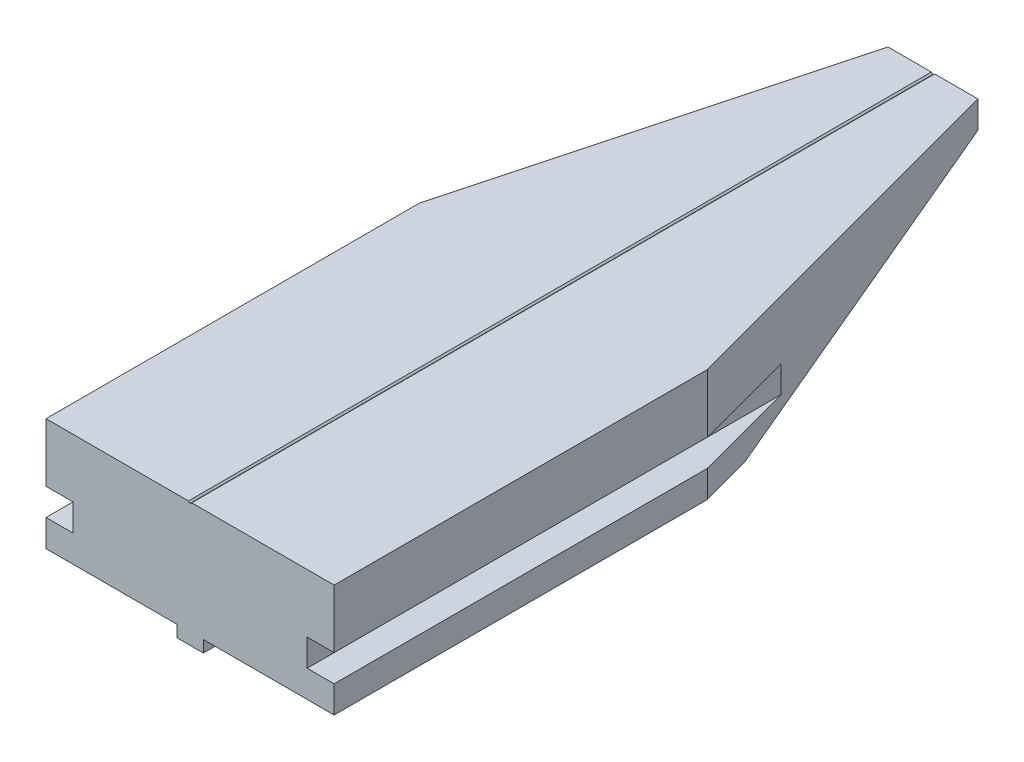
ISO-10303-21;
HEADER;
FILE_DESCRIPTION(('STEP AP214'),'2;1');
FILE_NAME('part.step','',(''),(''),'','','');
FILE_SCHEMA(('AUTOMOTIVE_DESIGN { 1 0 10303 214 1 1 1 1 }'));
ENDSEC;
DATA;
#1=APPLICATION_CONTEXT('core data for automotive mechanical design processes');
#2=APPLICATION_PROTOCOL_DEFINITION('international standard','automotive_design',2000,#1);
#3=PRODUCT_CONTEXT('',#1,'mechanical');
#4=PRODUCT('Part','Part','',(#3));
#5=PRODUCT_RELATED_PRODUCT_CATEGORY('part','',(#4));
#6=PRODUCT_DEFINITION_FORMATION('','',#4);
#7=PRODUCT_DEFINITION_CONTEXT('part definition',#1,'design');
#8=PRODUCT_DEFINITION('design','',#6,#7);
#9=PRODUCT_DEFINITION_SHAPE('','',#8);
#10=(LENGTH_UNIT() NAMED_UNIT(*) SI_UNIT(.MILLI.,.METRE.));
#11=(NAMED_UNIT(*) PLANE_ANGLE_UNIT() SI_UNIT($,.RADIAN.));
#12=(NAMED_UNIT(*) SI_UNIT($,.STERADIAN.) SOLID_ANGLE_UNIT());
#13=UNCERTAINTY_MEASURE_WITH_UNIT(LENGTH_MEASURE(1.E-05),#10,'distance_accuracy_value','');
#14=(GEOMETRIC_REPRESENTATION_CONTEXT(3) GLOBAL_UNCERTAINTY_ASSIGNED_CONTEXT((#13)) GLOBAL_UNIT_ASSIGNED_CONTEXT((#10,
#11,#12)) REPRESENTATION_CONTEXT('',''));
#15=CARTESIAN_POINT('',(0.,0.,0.));
#16=DIRECTION('',(0.,0.,1.));
#17=DIRECTION('',(1.,0.,0.));
#18=AXIS2_PLACEMENT_3D('',#15,#16,#17);
#19=CARTESIAN_POINT('',(-26.2642918635919,5.72280367008104,8.06086224835212));
#20=DIRECTION('',(0.,1.,0.));
#21=DIRECTION('',(-1.,0.,0.));
#22=AXIS2_PLACEMENT_3D('',#19,#20,#21);
#23=PLANE('',#22);
#24=CARTESIAN_POINT('',(-17.7642918635919,5.72280367008104,-21.9391377516479));
#25=DIRECTION('',(0.,-1.,0.));
#26=DIRECTION('',(0.,0.,-1.));
#27=AXIS2_PLACEMENT_3D('',#24,#25,#26);
#28=CIRCLE('',#27,1.25);
#29=CARTESIAN_POINT('',(-17.7642918635919,5.72280367008104,-23.1891377516479));
#30=VERTEX_POINT('',#29);
#31=EDGE_CURVE('E184',#30,#30,#28,.T.);
#32=ORIENTED_EDGE('',*,*,#31,.F.);
#33=EDGE_LOOP('',(#32));
#34=FACE_BOUND('',#33,.T.);
#35=DIRECTION('',(-0.258819045102521,0.,0.965925826289068));
#36=VECTOR('',#35,1.);
#37=CARTESIAN_POINT('',(-36.6261521427775,5.72280367008105,5.2844101544602));
#38=LINE('',#37,#36);
#39=CARTESIAN_POINT('',(-24.7642918635921,5.72280367008104,-38.9846550797426));
#40=VERTEX_POINT('',#39);
#41=CARTESIAN_POINT('',(-26.2642918635919,5.72280367008104,-33.3865788683903));
#42=VERTEX_POINT('',#41);
#43=EDGE_CURVE('E223',#40,#42,#38,.T.);
#44=ORIENTED_EDGE('',*,*,#43,.F.);
#45=DIRECTION('',(1.,0.,0.));
#46=VECTOR('',#45,1.);
#47=CARTESIAN_POINT('',(-26.2642918635928,5.72280367008104,-38.9846550797426));
#48=LINE('',#47,#46);
#49=CARTESIAN_POINT('',(-11.7392918635919,5.72280367008104,-38.9846550797429));
#50=VERTEX_POINT('',#49);
#51=EDGE_CURVE('E248',#40,#50,#48,.T.);
#52=ORIENTED_EDGE('',*,*,#51,.T.);
#53=DIRECTION('',(0.,0.,-1.));
#54=VECTOR('',#53,1.);
#55=CARTESIAN_POINT('',(-11.7392918635919,5.72280367008104,8.06086224835212));
#56=LINE('',#55,#54);
#57=CARTESIAN_POINT('',(-11.7392918635919,5.72280367008104,8.06086224835212));
#58=VERTEX_POINT('',#57);
#59=EDGE_CURVE('E355',#58,#50,#56,.T.);
#60=ORIENTED_EDGE('',*,*,#59,.F.);
#61=DIRECTION('',(1.,0.,0.));
#62=VECTOR('',#61,1.);
#63=CARTESIAN_POINT('',(-26.2642918635919,5.72280367008104,8.06086224835212));
#64=LINE('',#63,#62);
#65=CARTESIAN_POINT('',(-26.2642918635919,5.72280367008104,8.06086224835212));
#66=VERTEX_POINT('',#65);
#67=EDGE_CURVE('E265',#66,#58,#64,.T.);
#68=ORIENTED_EDGE('',*,*,#67,.F.);
#69=DIRECTION('',(0.,0.,-1.));
#70=VECTOR('',#69,1.);
#71=CARTESIAN_POINT('',(-26.2642918635919,5.72280367008104,8.06086224835212));
#72=LINE('',#71,#70);
#73=EDGE_CURVE('E309',#66,#42,#72,.T.);
#74=ORIENTED_EDGE('',*,*,#73,.T.);
#75=EDGE_LOOP('',(#44,#52,#60,#68,#74));
#76=FACE_BOUND('',#75,.T.);
#77=ADVANCED_FACE('F15',(#34,#76),#23,.F.);
#78=CARTESIAN_POINT('',(-26.2642918635919,18.222803670081,8.06086224835212));
#79=DIRECTION('',(0.,1.,0.));
#80=DIRECTION('',(-1.,0.,0.));
#81=AXIS2_PLACEMENT_3D('',#78,#79,#80);
#82=PLANE('',#81);
#83=DIRECTION('',(1.,0.,0.));
#84=VECTOR('',#83,1.);
#85=CARTESIAN_POINT('',(-26.2642918635919,18.222803670081,-74.4391377516479));
#86=LINE('',#85,#84);
#87=CARTESIAN_POINT('',(-15.2642918635919,18.222803670081,-74.4391377516479));
#88=VERTEX_POINT('',#87);
#89=CARTESIAN_POINT('',(-10.4453578807699,18.222803670081,-74.4391377516479));
#90=VERTEX_POINT('',#89);
#91=EDGE_CURVE('E269',#88,#90,#86,.T.);
#92=ORIENTED_EDGE('',*,*,#91,.F.);
#93=DIRECTION('',(-0.258819045102521,0.,0.965925826289068));
#94=VECTOR('',#93,1.);
#95=CARTESIAN_POINT('',(-15.2642918635919,18.222803670081,-74.4391377516479));
#96=LINE('',#95,#94);
#97=CARTESIAN_POINT('',(-26.2642918635919,18.222803670081,-33.3865788683903));
#98=VERTEX_POINT('',#97);
#99=EDGE_CURVE('E216',#88,#98,#96,.T.);
#100=ORIENTED_EDGE('',*,*,#99,.T.);
#101=DIRECTION('',(0.,0.,-1.));
#102=VECTOR('',#101,1.);
#103=CARTESIAN_POINT('',(-26.2642918635919,18.222803670081,8.06086224835212));
#104=LINE('',#103,#102);
#105=CARTESIAN_POINT('',(-26.2642918635919,18.222803670081,8.06086224835212));
#106=VERTEX_POINT('',#105);
#107=EDGE_CURVE('E325',#106,#98,#104,.T.);
#108=ORIENTED_EDGE('',*,*,#107,.F.);
#109=DIRECTION('',(1.,0.,0.));
#110=VECTOR('',#109,1.);
#111=CARTESIAN_POINT('',(-26.2642918635919,18.222803670081,8.06086224835212));
#112=LINE('',#111,#110);
#113=CARTESIAN_POINT('',(-10.4453578807699,18.222803670081,8.06086224835212));
#114=VERTEX_POINT('',#113);
#115=EDGE_CURVE('E291',#106,#114,#112,.T.);
#116=ORIENTED_EDGE('',*,*,#115,.T.);
#117=DIRECTION('',(0.,0.,1.));
#118=VECTOR('',#117,1.);
#119=CARTESIAN_POINT('',(-10.4453578807699,18.222803670081,-74.4391377516479));
#120=LINE('',#119,#118);
#121=EDGE_CURVE('E260',#90,#114,#120,.T.);
#122=ORIENTED_EDGE('',*,*,#121,.F.);
#123=EDGE_LOOP('',(#92,#100,#108,#116,#122));
#124=FACE_BOUND('',#123,.T.);
#125=ADVANCED_FACE('F391',(#124),#82,.T.);
#126=CARTESIAN_POINT('',(-26.2642918635919,11.722803670081,8.06086224835212));
#127=DIRECTION('',(-1.,0.,0.));
#128=DIRECTION('',(0.,-1.,0.));
#129=AXIS2_PLACEMENT_3D('',#126,#127,#128);
#130=PLANE('',#129);
#131=ORIENTED_EDGE('',*,*,#107,.T.);
#132=DIRECTION('',(0.,1.,0.));
#133=VECTOR('',#132,1.);
#134=CARTESIAN_POINT('',(-26.2642918635919,4.42280367008104,-33.3865788683903));
#135=LINE('',#134,#133);
#136=CARTESIAN_POINT('',(-26.2642918635919,11.722803670081,-33.3865788683903));
#137=VERTEX_POINT('',#136);
#138=EDGE_CURVE('E219',#137,#98,#135,.T.);
#139=ORIENTED_EDGE('',*,*,#138,.F.);
#140=DIRECTION('',(0.,0.,-1.));
#141=VECTOR('',#140,1.);
#142=CARTESIAN_POINT('',(-26.2642918635919,11.722803670081,8.06086224835212));
#143=LINE('',#142,#141);
#144=CARTESIAN_POINT('',(-26.2642918635919,11.722803670081,8.06086224835212));
#145=VERTEX_POINT('',#144);
#146=EDGE_CURVE('E322',#145,#137,#143,.T.);
#147=ORIENTED_EDGE('',*,*,#146,.F.);
#148=DIRECTION('',(0.,1.,0.));
#149=VECTOR('',#148,1.);
#150=CARTESIAN_POINT('',(-26.2642918635919,11.722803670081,8.06086224835212));
#151=LINE('',#150,#149);
#152=EDGE_CURVE('E294',#145,#106,#151,.T.);
#153=ORIENTED_EDGE('',*,*,#152,.T.);
#154=EDGE_LOOP('',(#131,#139,#147,#153));
#155=FACE_BOUND('',#154,.T.);
#156=ADVANCED_FACE('F396',(#155),#130,.T.);
#157=CARTESIAN_POINT('',(-23.2642918635919,11.722803670081,8.06086224835212));
#158=DIRECTION('',(0.,-1.,0.));
#159=DIRECTION('',(1.,0.,0.));
#160=AXIS2_PLACEMENT_3D('',#157,#158,#159);
#161=PLANE('',#160);
#162=ORIENTED_EDGE('',*,*,#146,.T.);
#163=DIRECTION('',(0.258819045102521,0.,-0.965925826289068));
#164=VECTOR('',#163,1.);
#165=CARTESIAN_POINT('',(-36.4251902484542,11.722803670081,4.5344101544602));
#166=LINE('',#165,#164);
#167=CARTESIAN_POINT('',(-23.2642918635919,11.722803670081,-44.5827312910969));
#168=VERTEX_POINT('',#167);
#169=EDGE_CURVE('E233',#137,#168,#166,.T.);
#170=ORIENTED_EDGE('',*,*,#169,.T.);
#171=DIRECTION('',(0.,0.,-1.));
#172=VECTOR('',#171,1.);
#173=CARTESIAN_POINT('',(-23.2642918635919,11.722803670081,8.06086224835212));
#174=LINE('',#173,#172);
#175=CARTESIAN_POINT('',(-23.2642918635919,11.722803670081,8.06086224835212));
#176=VERTEX_POINT('',#175);
#177=EDGE_CURVE('E319',#176,#168,#174,.T.);
#178=ORIENTED_EDGE('',*,*,#177,.F.);
#179=DIRECTION('',(-1.,0.,0.));
#180=VECTOR('',#179,1.);
#181=CARTESIAN_POINT('',(-23.2642918635919,11.722803670081,8.06086224835212));
#182=LINE('',#181,#180);
#183=EDGE_CURVE('E297',#176,#145,#182,.T.);
#184=ORIENTED_EDGE('',*,*,#183,.T.);
#185=EDGE_LOOP('',(#162,#170,#178,#184));
#186=FACE_BOUND('',#185,.T.);
#187=ADVANCED_FACE('F440',(#186),#161,.T.);
#188=CARTESIAN_POINT('',(-23.2642918635919,8.72280367008105,8.06086224835212));
#189=DIRECTION('',(-1.,0.,0.));
#190=DIRECTION('',(0.,-1.,0.));
#191=AXIS2_PLACEMENT_3D('',#188,#189,#190);
#192=PLANE('',#191);
#193=ORIENTED_EDGE('',*,*,#177,.T.);
#194=DIRECTION('',(0.,-1.,0.));
#195=VECTOR('',#194,1.);
#196=CARTESIAN_POINT('',(-23.2642918635919,8.72280367008251,-44.5827312910969));
#197=LINE('',#196,#195);
#198=CARTESIAN_POINT('',(-23.2642918635919,8.72280367008105,-44.5827312910969));
#199=VERTEX_POINT('',#198);
#200=EDGE_CURVE('E230',#168,#199,#197,.T.);
#201=ORIENTED_EDGE('',*,*,#200,.T.);
#202=DIRECTION('',(0.,0.,-1.));
#203=VECTOR('',#202,1.);
#204=CARTESIAN_POINT('',(-23.2642918635919,8.72280367008105,8.06086224835212));
#205=LINE('',#204,#203);
#206=CARTESIAN_POINT('',(-23.2642918635919,8.72280367008105,8.06086224835212));
#207=VERTEX_POINT('',#206);
#208=EDGE_CURVE('E316',#207,#199,#205,.T.);
#209=ORIENTED_EDGE('',*,*,#208,.F.);
#210=DIRECTION('',(0.,1.,0.));
#211=VECTOR('',#210,1.);
#212=CARTESIAN_POINT('',(-23.2642918635919,8.72280367008105,8.06086224835212));
#213=LINE('',#212,#211);
#214=EDGE_CURVE('E300',#207,#176,#213,.T.);
#215=ORIENTED_EDGE('',*,*,#214,.T.);
#216=EDGE_LOOP('',(#193,#201,#209,#215));
#217=FACE_BOUND('',#216,.T.);
#218=ADVANCED_FACE('F444',(#217),#192,.T.);
#219=CARTESIAN_POINT('',(-26.2642918635919,8.72280367008105,8.06086224835212));
#220=DIRECTION('',(0.,1.,0.));
#221=DIRECTION('',(0.,0.,1.));
#222=AXIS2_PLACEMENT_3D('',#219,#220,#221);
#223=PLANE('',#222);
#224=ORIENTED_EDGE('',*,*,#208,.T.);
#225=DIRECTION('',(-0.258819045102521,0.,0.965925826289068));
#226=VECTOR('',#225,1.);
#227=CARTESIAN_POINT('',(-36.6261521427775,8.72280367008105,5.2844101544602));
#228=LINE('',#227,#226);
#229=CARTESIAN_POINT('',(-26.2642918635919,8.72280367008105,-33.3865788683903));
#230=VERTEX_POINT('',#229);
#231=EDGE_CURVE('E227',#199,#230,#228,.T.);
#232=ORIENTED_EDGE('',*,*,#231,.T.);
#233=DIRECTION('',(0.,0.,-1.));
#234=VECTOR('',#233,1.);
#235=CARTESIAN_POINT('',(-26.2642918635919,8.72280367008105,8.06086224835212));
#236=LINE('',#235,#234);
#237=CARTESIAN_POINT('',(-26.2642918635919,8.72280367008105,8.06086224835212));
#238=VERTEX_POINT('',#237);
#239=EDGE_CURVE('E313',#238,#230,#236,.T.);
#240=ORIENTED_EDGE('',*,*,#239,.F.);
#241=DIRECTION('',(1.,0.,0.));
#242=VECTOR('',#241,1.);
#243=CARTESIAN_POINT('',(-26.2642918635919,8.72280367008105,8.06086224835212));
#244=LINE('',#243,#242);
#245=EDGE_CURVE('E303',#238,#207,#244,.T.);
#246=ORIENTED_EDGE('',*,*,#245,.T.);
#247=EDGE_LOOP('',(#224,#232,#240,#246));
#248=FACE_BOUND('',#247,.T.);
#249=ADVANCED_FACE('F448',(#248),#223,.T.);
#250=CARTESIAN_POINT('',(-26.2642918635919,5.72280367008104,8.06086224835212));
#251=DIRECTION('',(-1.,0.,0.));
#252=DIRECTION('',(0.,-1.,0.));
#253=AXIS2_PLACEMENT_3D('',#250,#251,#252);
#254=PLANE('',#253);
#255=ORIENTED_EDGE('',*,*,#239,.T.);
#256=EDGE_CURVE('E224',#42,#230,#135,.T.);
#257=ORIENTED_EDGE('',*,*,#256,.F.);
#258=ORIENTED_EDGE('',*,*,#73,.F.);
#259=DIRECTION('',(0.,1.,0.));
#260=VECTOR('',#259,1.);
#261=CARTESIAN_POINT('',(-26.2642918635919,5.72280367008104,8.06086224835212));
#262=LINE('',#261,#260);
#263=EDGE_CURVE('E306',#66,#238,#262,.T.);
#264=ORIENTED_EDGE('',*,*,#263,.T.);
#265=EDGE_LOOP('',(#255,#257,#258,#264));
#266=FACE_BOUND('',#265,.T.);
#267=ADVANCED_FACE('F452',(#266),#254,.T.);
#268=CARTESIAN_POINT('',(-11.7392918635919,5.72280367008104,-74.4391377516479));
#269=DIRECTION('',(0.,0.,-1.));
#270=DIRECTION('',(-1.,0.,0.));
#271=AXIS2_PLACEMENT_3D('',#268,#269,#270);
#272=PLANE('',#271);
#273=DIRECTION('',(0.,1.,0.));
#274=VECTOR('',#273,1.);
#275=CARTESIAN_POINT('',(-5.26429186359187,4.42280367008104,-74.4391377516479));
#276=LINE('',#275,#274);
#277=CARTESIAN_POINT('',(-5.26429186359187,15.2228036700809,-74.4391377516479));
#278=VERTEX_POINT('',#277);
#279=CARTESIAN_POINT('',(-5.26429186359187,18.222803670081,-74.4391377516479));
#280=VERTEX_POINT('',#279);
#281=EDGE_CURVE('E197',#278,#280,#276,.T.);
#282=ORIENTED_EDGE('',*,*,#281,.F.);
#283=DIRECTION('',(-1.,0.,0.));
#284=VECTOR('',#283,1.);
#285=CARTESIAN_POINT('',(5.73570813640819,15.2228036700809,-74.4391377516479));
#286=LINE('',#285,#284);
#287=CARTESIAN_POINT('',(-15.2642918635919,15.222803670081,-74.4391377516479));
#288=VERTEX_POINT('',#287);
#289=EDGE_CURVE('E236',#278,#288,#286,.T.);
#290=ORIENTED_EDGE('',*,*,#289,.T.);
#291=DIRECTION('',(0.,1.,0.));
#292=VECTOR('',#291,1.);
#293=CARTESIAN_POINT('',(-15.2642918635919,4.42280367008104,-74.4391377516479));
#294=LINE('',#293,#292);
#295=EDGE_CURVE('E220',#288,#88,#294,.T.);
#296=ORIENTED_EDGE('',*,*,#295,.T.);
#297=ORIENTED_EDGE('',*,*,#91,.T.);
#298=DIRECTION('',(0.707106781186556,-0.707106781186539,0.));
#299=VECTOR('',#298,1.);
#300=CARTESIAN_POINT('',(-10.4453578807699,18.222803670081,-74.4391377516479));
#301=LINE('',#300,#299);
#302=CARTESIAN_POINT('',(-10.2855050670275,18.0629508563387,-74.4391377516479));
#303=VERTEX_POINT('',#302);
#304=EDGE_CURVE('E251',#90,#303,#301,.T.);
#305=ORIENTED_EDGE('',*,*,#304,.T.);
#306=CARTESIAN_POINT('',(-10.2642918635919,18.0841640597743,-74.4391377516479));
#307=DIRECTION('',(0.,0.,-1.));
#308=DIRECTION('',(-1.,0.,0.));
#309=AXIS2_PLACEMENT_3D('',#306,#307,#308);
#310=CIRCLE('',#309,0.03);
#311=CARTESIAN_POINT('',(-10.2430786601563,18.0629508563387,-74.4391377516479));
#312=VERTEX_POINT('',#311);
#313=EDGE_CURVE('E10',#303,#312,#310,.F.);
#314=ORIENTED_EDGE('',*,*,#313,.T.);
#315=DIRECTION('',(-0.707106781186556,-0.707106781186539,0.));
#316=VECTOR('',#315,1.);
#317=CARTESIAN_POINT('',(-10.0832258464139,18.222803670081,-74.4391377516479));
#318=LINE('',#317,#316);
#319=CARTESIAN_POINT('',(-10.0832258464139,18.2228036700811,-74.4391377516479));
#320=VERTEX_POINT('',#319);
#321=EDGE_CURVE('E253',#320,#312,#318,.T.);
#322=ORIENTED_EDGE('',*,*,#321,.F.);
#323=EDGE_CURVE('E262',#320,#280,#86,.T.);
#324=ORIENTED_EDGE('',*,*,#323,.T.);
#325=EDGE_LOOP('',(#282,#290,#296,#297,#305,#314,#322,#324));
#326=FACE_BOUND('',#325,.T.);
#327=ADVANCED_FACE('F383',(#326),#272,.T.);
#328=CARTESIAN_POINT('',(5.73570813640811,1.19460200142603,-22.0851763854041));
#329=DIRECTION('',(0.,0.96592582628907,0.258819045102514));
#330=DIRECTION('',(0.,-0.258819045102514,0.96592582628907));
#331=AXIS2_PLACEMENT_3D('',#328,#329,#330);
#332=PLANE('',#331);
#333=ORIENTED_EDGE('',*,*,#289,.F.);
#334=DIRECTION('',(0.250562807085732,-0.250562807085727,0.93511312653103));
#335=VECTOR('',#334,1.);
#336=CARTESIAN_POINT('',(8.57379409490597,1.38471771158341,-22.7946978750286));
#337=LINE('',#336,#335);
#338=CARTESIAN_POINT('',(4.23570813640823,5.72280367008104,-38.9846550797433));
#339=VERTEX_POINT('',#338);
#340=EDGE_CURVE('E213',#278,#339,#337,.T.);
#341=ORIENTED_EDGE('',*,*,#340,.T.);
#342=DIRECTION('',(-1.,0.,0.));
#343=VECTOR('',#342,1.);
#344=CARTESIAN_POINT('',(5.73570813640709,5.72280367008104,-38.9846550797433));
#345=LINE('',#344,#343);
#346=CARTESIAN_POINT('',(-8.78929186359185,5.72280367008104,-38.9846550797429));
#347=VERTEX_POINT('',#346);
#348=EDGE_CURVE('E238',#339,#347,#345,.T.);
#349=ORIENTED_EDGE('',*,*,#348,.T.);
#350=DIRECTION('',(0.,-0.258819045102514,0.96592582628907));
#351=VECTOR('',#350,1.);
#352=CARTESIAN_POINT('',(-8.78929186359205,-6.03857566194245,4.90941015446041));
#353=LINE('',#352,#351);
#354=CARTESIAN_POINT('',(-8.78929186359187,4.42280367008104,-34.1329890299033));
#355=VERTEX_POINT('',#354);
#356=EDGE_CURVE('E240',#347,#355,#353,.T.);
#357=ORIENTED_EDGE('',*,*,#356,.T.);
#358=DIRECTION('',(1.,0.,0.));
#359=VECTOR('',#358,1.);
#360=CARTESIAN_POINT('',(-11.7392918635929,4.42280367008104,-34.1329890299032));
#361=LINE('',#360,#359);
#362=CARTESIAN_POINT('',(-11.7392918635919,4.42280367008104,-34.1329890299032));
#363=VERTEX_POINT('',#362);
#364=EDGE_CURVE('E242',#363,#355,#361,.T.);
#365=ORIENTED_EDGE('',*,*,#364,.F.);
#366=DIRECTION('',(0.,-0.258819045102514,0.96592582628907));
#367=VECTOR('',#366,1.);
#368=CARTESIAN_POINT('',(-11.7392918635919,-6.03857566194243,4.90941015446042));
#369=LINE('',#368,#367);
#370=EDGE_CURVE('E245',#50,#363,#369,.T.);
#371=ORIENTED_EDGE('',*,*,#370,.F.);
#372=ORIENTED_EDGE('',*,*,#51,.F.);
#373=DIRECTION('',(-0.250562807085733,-0.250562807085724,0.935113126531031));
#374=VECTOR('',#373,1.);
#375=CARTESIAN_POINT('',(-27.0933627726599,3.39373276101337,-30.2924441126711));
#376=LINE('',#375,#374);
#377=EDGE_CURVE('E358',#288,#40,#376,.T.);
#378=ORIENTED_EDGE('',*,*,#377,.F.);
#379=EDGE_LOOP('',(#333,#341,#349,#357,#365,#371,#372,#378));
#380=FACE_BOUND('',#379,.T.);
#381=ADVANCED_FACE('F459',(#380),#332,.F.);
#382=DIRECTION('',(0.258819045102521,0.,0.965925826289068));
#383=VECTOR('',#382,1.);
#384=CARTESIAN_POINT('',(-5.26429186359187,18.222803670081,-74.4391377516479));
#385=LINE('',#384,#383);
#386=CARTESIAN_POINT('',(5.73570813640813,18.2228036700811,-33.3865788683903));
#387=VERTEX_POINT('',#386);
#388=EDGE_CURVE('E195',#280,#387,#385,.T.);
#389=ORIENTED_EDGE('',*,*,#388,.F.);
#390=ORIENTED_EDGE('',*,*,#323,.F.);
#391=DIRECTION('',(0.,0.,1.));
#392=VECTOR('',#391,1.);
#393=CARTESIAN_POINT('',(-10.0832258464139,18.222803670081,-74.4391377516479));
#394=LINE('',#393,#392);
#395=CARTESIAN_POINT('',(-10.0832258464139,18.222803670081,8.06086224835212));
#396=VERTEX_POINT('',#395);
#397=EDGE_CURVE('E257',#320,#396,#394,.T.);
#398=ORIENTED_EDGE('',*,*,#397,.T.);
#399=CARTESIAN_POINT('',(5.73570813640813,18.2228036700811,8.06086224835212));
#400=VERTEX_POINT('',#399);
#401=EDGE_CURVE('E290',#396,#400,#112,.T.);
#402=ORIENTED_EDGE('',*,*,#401,.T.);
#403=DIRECTION('',(0.,0.,-1.));
#404=VECTOR('',#403,1.);
#405=CARTESIAN_POINT('',(5.73570813640813,18.2228036700811,8.06086224835212));
#406=LINE('',#405,#404);
#407=EDGE_CURVE('E328',#400,#387,#406,.T.);
#408=ORIENTED_EDGE('',*,*,#407,.T.);
#409=EDGE_LOOP('',(#389,#390,#398,#402,#408));
#410=FACE_BOUND('',#409,.T.);
#411=ADVANCED_FACE('F378',(#410),#82,.T.);
#412=CARTESIAN_POINT('',(-11.7392918635919,5.72280367008104,8.06086224835212));
#413=DIRECTION('',(1.,0.,0.));
#414=DIRECTION('',(0.,0.,-1.));
#415=AXIS2_PLACEMENT_3D('',#412,#413,#414);
#416=PLANE('',#415);
#417=ORIENTED_EDGE('',*,*,#59,.T.);
#418=ORIENTED_EDGE('',*,*,#370,.T.);
#419=DIRECTION('',(0.,0.,-1.));
#420=VECTOR('',#419,1.);
#421=CARTESIAN_POINT('',(-11.7392918635919,4.42280367008104,8.06086224835212));
#422=LINE('',#421,#420);
#423=CARTESIAN_POINT('',(-11.7392918635919,4.42280367008104,8.06086224835212));
#424=VERTEX_POINT('',#423);
#425=EDGE_CURVE('E352',#424,#363,#422,.T.);
#426=ORIENTED_EDGE('',*,*,#425,.F.);
#427=DIRECTION('',(0.,-1.,0.));
#428=VECTOR('',#427,1.);
#429=CARTESIAN_POINT('',(-11.7392918635919,5.72280367008104,8.06086224835212));
#430=LINE('',#429,#428);
#431=EDGE_CURVE('E268',#58,#424,#430,.T.);
#432=ORIENTED_EDGE('',*,*,#431,.F.);
#433=EDGE_LOOP('',(#417,#418,#426,#432));
#434=FACE_BOUND('',#433,.T.);
#435=ADVANCED_FACE('F402',(#434),#416,.F.);
#436=CARTESIAN_POINT('',(-11.7392918635919,4.42280367008104,8.06086224835212));
#437=DIRECTION('',(0.,1.,0.));
#438=DIRECTION('',(-1.,0.,0.));
#439=AXIS2_PLACEMENT_3D('',#436,#437,#438);
#440=PLANE('',#439);
#441=ORIENTED_EDGE('',*,*,#425,.T.);
#442=ORIENTED_EDGE('',*,*,#364,.T.);
#443=DIRECTION('',(0.,0.,-1.));
#444=VECTOR('',#443,1.);
#445=CARTESIAN_POINT('',(-8.78929186359187,4.42280367008104,8.06086224835212));
#446=LINE('',#445,#444);
#447=CARTESIAN_POINT('',(-8.78929186359187,4.42280367008104,8.06086224835212));
#448=VERTEX_POINT('',#447);
#449=EDGE_CURVE('E349',#448,#355,#446,.T.);
#450=ORIENTED_EDGE('',*,*,#449,.F.);
#451=DIRECTION('',(1.,0.,0.));
#452=VECTOR('',#451,1.);
#453=CARTESIAN_POINT('',(-11.7392918635919,4.42280367008104,8.06086224835212));
#454=LINE('',#453,#452);
#455=EDGE_CURVE('E271',#424,#448,#454,.T.);
#456=ORIENTED_EDGE('',*,*,#455,.F.);
#457=EDGE_LOOP('',(#441,#442,#450,#456));
#458=FACE_BOUND('',#457,.T.);
#459=ADVANCED_FACE('F405',(#458),#440,.F.);
#460=CARTESIAN_POINT('',(-8.78929186359185,5.72280367008104,8.06086224835212));
#461=DIRECTION('',(1.,0.,0.));
#462=DIRECTION('',(0.,1.,0.));
#463=AXIS2_PLACEMENT_3D('',#460,#461,#462);
#464=PLANE('',#463);
#465=ORIENTED_EDGE('',*,*,#356,.F.);
#466=DIRECTION('',(0.,0.,-1.));
#467=VECTOR('',#466,1.);
#468=CARTESIAN_POINT('',(-8.78929186359185,5.72280367008104,8.06086224835212));
#469=LINE('',#468,#467);
#470=CARTESIAN_POINT('',(-8.78929186359185,5.72280367008104,8.06086224835212));
#471=VERTEX_POINT('',#470);
#472=EDGE_CURVE('E346',#471,#347,#469,.T.);
#473=ORIENTED_EDGE('',*,*,#472,.F.);
#474=DIRECTION('',(0.,-1.,0.));
#475=VECTOR('',#474,1.);
#476=CARTESIAN_POINT('',(-8.78929186359185,5.72280367008104,8.06086224835212));
#477=LINE('',#476,#475);
#478=EDGE_CURVE('E273',#471,#448,#477,.T.);
#479=ORIENTED_EDGE('',*,*,#478,.T.);
#480=ORIENTED_EDGE('',*,*,#449,.T.);
#481=EDGE_LOOP('',(#465,#473,#479,#480));
#482=FACE_BOUND('',#481,.T.);
#483=ADVANCED_FACE('F409',(#482),#464,.T.);
#484=CARTESIAN_POINT('',(5.73570813640812,5.72280367008104,8.06086224835212));
#485=DIRECTION('',(0.,-1.,0.));
#486=DIRECTION('',(1.,0.,0.));
#487=AXIS2_PLACEMENT_3D('',#484,#485,#486);
#488=PLANE('',#487);
#489=CARTESIAN_POINT('',(-2.76429186359189,5.72280367008104,-21.9391377516479));
#490=DIRECTION('',(0.,-1.,0.));
#491=DIRECTION('',(0.,0.,-1.));
#492=AXIS2_PLACEMENT_3D('',#489,#490,#491);
#493=CIRCLE('',#492,1.25);
#494=CARTESIAN_POINT('',(-2.76429186359189,5.72280367008104,-23.1891377516479));
#495=VERTEX_POINT('',#494);
#496=EDGE_CURVE('E185',#495,#495,#493,.T.);
#497=ORIENTED_EDGE('',*,*,#496,.F.);
#498=EDGE_LOOP('',(#497));
#499=FACE_BOUND('',#498,.T.);
#500=DIRECTION('',(-0.258819045102521,0.,-0.965925826289068));
#501=VECTOR('',#500,1.);
#502=CARTESIAN_POINT('',(16.0975684155938,5.72280367008104,5.2844101544602));
#503=LINE('',#502,#501);
#504=CARTESIAN_POINT('',(5.73570813640813,5.72280367008104,-33.3865788683903));
#505=VERTEX_POINT('',#504);
#506=EDGE_CURVE('E211',#505,#339,#503,.T.);
#507=ORIENTED_EDGE('',*,*,#506,.F.);
#508=DIRECTION('',(0.,0.,-1.));
#509=VECTOR('',#508,1.);
#510=CARTESIAN_POINT('',(5.73570813640812,5.72280367008104,8.06086224835212));
#511=LINE('',#510,#509);
#512=CARTESIAN_POINT('',(5.73570813640812,5.72280367008104,8.06086224835212));
#513=VERTEX_POINT('',#512);
#514=EDGE_CURVE('E343',#513,#505,#511,.T.);
#515=ORIENTED_EDGE('',*,*,#514,.F.);
#516=DIRECTION('',(-1.,0.,0.));
#517=VECTOR('',#516,1.);
#518=CARTESIAN_POINT('',(5.73570813640812,5.72280367008104,8.06086224835212));
#519=LINE('',#518,#517);
#520=EDGE_CURVE('E276',#513,#471,#519,.T.);
#521=ORIENTED_EDGE('',*,*,#520,.T.);
#522=ORIENTED_EDGE('',*,*,#472,.T.);
#523=ORIENTED_EDGE('',*,*,#348,.F.);
#524=EDGE_LOOP('',(#507,#515,#521,#522,#523));
#525=FACE_BOUND('',#524,.T.);
#526=ADVANCED_FACE('F413',(#499,#525),#488,.T.);
#527=CARTESIAN_POINT('',(5.73570813640812,5.72280367008104,8.06086224835212));
#528=DIRECTION('',(-1.,0.,0.));
#529=DIRECTION('',(0.,-1.,0.));
#530=AXIS2_PLACEMENT_3D('',#527,#528,#529);
#531=PLANE('',#530);
#532=ORIENTED_EDGE('',*,*,#514,.T.);
#533=DIRECTION('',(0.,1.,0.));
#534=VECTOR('',#533,1.);
#535=CARTESIAN_POINT('',(5.73570813640813,4.42280367008104,-33.3865788683903));
#536=LINE('',#535,#534);
#537=CARTESIAN_POINT('',(5.73570813640813,8.72280367008104,-33.3865788683903));
#538=VERTEX_POINT('',#537);
#539=EDGE_CURVE('E199',#505,#538,#536,.T.);
#540=ORIENTED_EDGE('',*,*,#539,.T.);
#541=DIRECTION('',(0.,0.,-1.));
#542=VECTOR('',#541,1.);
#543=CARTESIAN_POINT('',(5.73570813640812,8.72280367008105,8.06086224835212));
#544=LINE('',#543,#542);
#545=CARTESIAN_POINT('',(5.73570813640812,8.72280367008105,8.06086224835212));
#546=VERTEX_POINT('',#545);
#547=EDGE_CURVE('E340',#546,#538,#544,.T.);
#548=ORIENTED_EDGE('',*,*,#547,.F.);
#549=DIRECTION('',(0.,1.,0.));
#550=VECTOR('',#549,1.);
#551=CARTESIAN_POINT('',(5.73570813640812,5.72280367008104,8.06086224835212));
#552=LINE('',#551,#550);
#553=EDGE_CURVE('E279',#513,#546,#552,.T.);
#554=ORIENTED_EDGE('',*,*,#553,.F.);
#555=EDGE_LOOP('',(#532,#540,#548,#554));
#556=FACE_BOUND('',#555,.T.);
#557=ADVANCED_FACE('F417',(#556),#531,.F.);
#558=CARTESIAN_POINT('',(5.73570813640812,8.72280367008105,8.06086224835212));
#559=DIRECTION('',(0.,-1.,0.));
#560=DIRECTION('',(1.,0.,0.));
#561=AXIS2_PLACEMENT_3D('',#558,#559,#560);
#562=PLANE('',#561);
#563=ORIENTED_EDGE('',*,*,#547,.T.);
#564=DIRECTION('',(-0.258819045102521,0.,-0.965925826289068));
#565=VECTOR('',#564,1.);
#566=CARTESIAN_POINT('',(16.0975684155938,8.72280367008107,5.2844101544602));
#567=LINE('',#566,#565);
#568=CARTESIAN_POINT('',(2.73570813640813,8.72280367008104,-44.5827312910969));
#569=VERTEX_POINT('',#568);
#570=EDGE_CURVE('E208',#538,#569,#567,.T.);
#571=ORIENTED_EDGE('',*,*,#570,.T.);
#572=DIRECTION('',(0.,0.,-1.));
#573=VECTOR('',#572,1.);
#574=CARTESIAN_POINT('',(2.73570813640813,8.72280367008104,8.06086224835212));
#575=LINE('',#574,#573);
#576=CARTESIAN_POINT('',(2.73570813640813,8.72280367008104,8.06086224835212));
#577=VERTEX_POINT('',#576);
#578=EDGE_CURVE('E337',#577,#569,#575,.T.);
#579=ORIENTED_EDGE('',*,*,#578,.F.);
#580=DIRECTION('',(-1.,0.,0.));
#581=VECTOR('',#580,1.);
#582=CARTESIAN_POINT('',(5.73570813640812,8.72280367008105,8.06086224835212));
#583=LINE('',#582,#581);
#584=EDGE_CURVE('E281',#546,#577,#583,.T.);
#585=ORIENTED_EDGE('',*,*,#584,.F.);
#586=EDGE_LOOP('',(#563,#571,#579,#585));
#587=FACE_BOUND('',#586,.T.);
#588=ADVANCED_FACE('F421',(#587),#562,.F.);
#589=CARTESIAN_POINT('',(2.73570813640813,8.72280367008104,8.06086224835212));
#590=DIRECTION('',(-1.,0.,0.));
#591=DIRECTION('',(0.,0.,1.));
#592=AXIS2_PLACEMENT_3D('',#589,#590,#591);
#593=PLANE('',#592);
#594=ORIENTED_EDGE('',*,*,#578,.T.);
#595=DIRECTION('',(0.,1.,0.));
#596=VECTOR('',#595,1.);
#597=CARTESIAN_POINT('',(2.73570813640813,8.72280367008106,-44.5827312910969));
#598=LINE('',#597,#596);
#599=CARTESIAN_POINT('',(2.73570813640813,11.722803670081,-44.5827312910969));
#600=VERTEX_POINT('',#599);
#601=EDGE_CURVE('E205',#569,#600,#598,.T.);
#602=ORIENTED_EDGE('',*,*,#601,.T.);
#603=DIRECTION('',(0.,0.,-1.));
#604=VECTOR('',#603,1.);
#605=CARTESIAN_POINT('',(2.73570813640813,11.722803670081,8.06086224835212));
#606=LINE('',#605,#604);
#607=CARTESIAN_POINT('',(2.73570813640813,11.722803670081,8.06086224835212));
#608=VERTEX_POINT('',#607);
#609=EDGE_CURVE('E334',#608,#600,#606,.T.);
#610=ORIENTED_EDGE('',*,*,#609,.F.);
#611=DIRECTION('',(0.,1.,0.));
#612=VECTOR('',#611,1.);
#613=CARTESIAN_POINT('',(2.73570813640813,8.72280367008104,8.06086224835212));
#614=LINE('',#613,#612);
#615=EDGE_CURVE('E283',#577,#608,#614,.T.);
#616=ORIENTED_EDGE('',*,*,#615,.F.);
#617=EDGE_LOOP('',(#594,#602,#610,#616));
#618=FACE_BOUND('',#617,.T.);
#619=ADVANCED_FACE('F425',(#618),#593,.F.);
#620=CARTESIAN_POINT('',(2.73570813640813,11.722803670081,8.06086224835212));
#621=DIRECTION('',(0.,1.,0.));
#622=DIRECTION('',(-1.,0.,0.));
#623=AXIS2_PLACEMENT_3D('',#620,#621,#622);
#624=PLANE('',#623);
#625=ORIENTED_EDGE('',*,*,#609,.T.);
#626=DIRECTION('',(0.258819045102521,0.,0.965925826289068));
#627=VECTOR('',#626,1.);
#628=CARTESIAN_POINT('',(15.8966065212704,11.722803670081,4.5344101544602));
#629=LINE('',#628,#627);
#630=CARTESIAN_POINT('',(5.73570813640813,11.722803670081,-33.3865788683903));
#631=VERTEX_POINT('',#630);
#632=EDGE_CURVE('E202',#600,#631,#629,.T.);
#633=ORIENTED_EDGE('',*,*,#632,.T.);
#634=DIRECTION('',(0.,0.,-1.));
#635=VECTOR('',#634,1.);
#636=CARTESIAN_POINT('',(5.73570813640812,11.722803670081,8.06086224835212));
#637=LINE('',#636,#635);
#638=CARTESIAN_POINT('',(5.73570813640812,11.722803670081,8.06086224835212));
#639=VERTEX_POINT('',#638);
#640=EDGE_CURVE('E331',#639,#631,#637,.T.);
#641=ORIENTED_EDGE('',*,*,#640,.F.);
#642=DIRECTION('',(1.,0.,0.));
#643=VECTOR('',#642,1.);
#644=CARTESIAN_POINT('',(2.73570813640813,11.722803670081,8.06086224835212));
#645=LINE('',#644,#643);
#646=EDGE_CURVE('E285',#608,#639,#645,.T.);
#647=ORIENTED_EDGE('',*,*,#646,.F.);
#648=EDGE_LOOP('',(#625,#633,#641,#647));
#649=FACE_BOUND('',#648,.T.);
#650=ADVANCED_FACE('F429',(#649),#624,.F.);
#651=CARTESIAN_POINT('',(5.73570813640812,11.722803670081,8.06086224835212));
#652=DIRECTION('',(-1.,0.,0.));
#653=DIRECTION('',(0.,-1.,0.));
#654=AXIS2_PLACEMENT_3D('',#651,#652,#653);
#655=PLANE('',#654);
#656=ORIENTED_EDGE('',*,*,#640,.T.);
#657=DIRECTION('',(0.,1.,0.));
#658=VECTOR('',#657,1.);
#659=CARTESIAN_POINT('',(5.73570813640812,11.7228036700812,-33.3865788683903));
#660=LINE('',#659,#658);
#661=EDGE_CURVE('E360',#631,#387,#660,.T.);
#662=ORIENTED_EDGE('',*,*,#661,.T.);
#663=ORIENTED_EDGE('',*,*,#407,.F.);
#664=DIRECTION('',(0.,1.,0.));
#665=VECTOR('',#664,1.);
#666=CARTESIAN_POINT('',(5.73570813640812,11.722803670081,8.06086224835212));
#667=LINE('',#666,#665);
#668=EDGE_CURVE('E287',#639,#400,#667,.T.);
#669=ORIENTED_EDGE('',*,*,#668,.F.);
#670=EDGE_LOOP('',(#656,#662,#663,#669));
#671=FACE_BOUND('',#670,.T.);
#672=ADVANCED_FACE('F433',(#671),#655,.F.);
#673=CARTESIAN_POINT('',(-11.7392918635919,5.72280367008104,8.06086224835212));
#674=DIRECTION('',(0.,0.,-1.));
#675=DIRECTION('',(-1.,0.,0.));
#676=AXIS2_PLACEMENT_3D('',#673,#674,#675);
#677=PLANE('',#676);
#678=DIRECTION('',(-0.707106781186556,-0.707106781186539,0.));
#679=VECTOR('',#678,1.);
#680=CARTESIAN_POINT('',(-10.0832258464139,18.222803670081,8.06086224835212));
#681=LINE('',#680,#679);
#682=CARTESIAN_POINT('',(-10.2430786601563,18.0629508563387,8.06086224835212));
#683=VERTEX_POINT('',#682);
#684=EDGE_CURVE('E254',#396,#683,#681,.T.);
#685=ORIENTED_EDGE('',*,*,#684,.T.);
#686=CARTESIAN_POINT('',(-10.2642918635919,18.0841640597743,8.06086224835212));
#687=DIRECTION('',(0.,0.,-1.));
#688=DIRECTION('',(-1.,0.,0.));
#689=AXIS2_PLACEMENT_3D('',#686,#687,#688);
#690=CIRCLE('',#689,0.03);
#691=CARTESIAN_POINT('',(-10.2855050670275,18.0629508563387,8.06086224835212));
#692=VERTEX_POINT('',#691);
#693=EDGE_CURVE('E23',#683,#692,#690,.T.);
#694=ORIENTED_EDGE('',*,*,#693,.T.);
#695=DIRECTION('',(0.707106781186556,-0.707106781186539,0.));
#696=VECTOR('',#695,1.);
#697=CARTESIAN_POINT('',(-10.4453578807699,18.222803670081,8.06086224835212));
#698=LINE('',#697,#696);
#699=EDGE_CURVE('E250',#114,#692,#698,.T.);
#700=ORIENTED_EDGE('',*,*,#699,.F.);
#701=ORIENTED_EDGE('',*,*,#115,.F.);
#702=ORIENTED_EDGE('',*,*,#152,.F.);
#703=ORIENTED_EDGE('',*,*,#183,.F.);
#704=ORIENTED_EDGE('',*,*,#214,.F.);
#705=ORIENTED_EDGE('',*,*,#245,.F.);
#706=ORIENTED_EDGE('',*,*,#263,.F.);
#707=ORIENTED_EDGE('',*,*,#67,.T.);
#708=ORIENTED_EDGE('',*,*,#431,.T.);
#709=ORIENTED_EDGE('',*,*,#455,.T.);
#710=ORIENTED_EDGE('',*,*,#478,.F.);
#711=ORIENTED_EDGE('',*,*,#520,.F.);
#712=ORIENTED_EDGE('',*,*,#553,.T.);
#713=ORIENTED_EDGE('',*,*,#584,.T.);
#714=ORIENTED_EDGE('',*,*,#615,.T.);
#715=ORIENTED_EDGE('',*,*,#646,.T.);
#716=ORIENTED_EDGE('',*,*,#668,.T.);
#717=ORIENTED_EDGE('',*,*,#401,.F.);
#718=EDGE_LOOP('',(#685,#694,#700,#701,#702,#703,#704,#705,#706,#707,#708,#709,#710,#711,#712,
#713,#714,#715,#716,#717));
#719=FACE_BOUND('',#718,.T.);
#720=ADVANCED_FACE('F373',(#719),#677,.F.);
#721=CARTESIAN_POINT('',(-10.4453578807699,18.222803670081,-74.4391377516479));
#722=DIRECTION('',(-0.707106781186539,-0.707106781186556,0.));
#723=DIRECTION('',(0.707106781186556,-0.707106781186539,0.));
#724=AXIS2_PLACEMENT_3D('',#721,#722,#723);
#725=PLANE('',#724);
#726=ORIENTED_EDGE('',*,*,#699,.T.);
#727=DIRECTION('',(0.,0.,1.));
#728=VECTOR('',#727,1.);
#729=CARTESIAN_POINT('',(-10.2855050670275,18.0629508563387,-74.4391377516479));
#730=LINE('',#729,#728);
#731=EDGE_CURVE('E30',#692,#303,#730,.F.);
#732=ORIENTED_EDGE('',*,*,#731,.T.);
#733=ORIENTED_EDGE('',*,*,#304,.F.);
#734=ORIENTED_EDGE('',*,*,#121,.T.);
#735=EDGE_LOOP('',(#726,#732,#733,#734));
#736=FACE_BOUND('',#735,.T.);
#737=ADVANCED_FACE('F462',(#736),#725,.F.);
#738=CARTESIAN_POINT('',(-10.0832258464139,18.222803670081,-74.4391377516479));
#739=DIRECTION('',(-0.707106781186539,0.707106781186556,0.));
#740=DIRECTION('',(-0.707106781186556,-0.707106781186539,0.));
#741=AXIS2_PLACEMENT_3D('',#738,#739,#740);
#742=PLANE('',#741);
#743=ORIENTED_EDGE('',*,*,#321,.T.);
#744=DIRECTION('',(0.,0.,1.));
#745=VECTOR('',#744,1.);
#746=CARTESIAN_POINT('',(-10.2430786601563,18.0629508563387,-74.4391377516479));
#747=LINE('',#746,#745);
#748=EDGE_CURVE('E363',#312,#683,#747,.T.);
#749=ORIENTED_EDGE('',*,*,#748,.T.);
#750=ORIENTED_EDGE('',*,*,#684,.F.);
#751=ORIENTED_EDGE('',*,*,#397,.F.);
#752=EDGE_LOOP('',(#743,#749,#750,#751));
#753=FACE_BOUND('',#752,.T.);
#754=ADVANCED_FACE('F368',(#753),#742,.T.);
#755=CARTESIAN_POINT('',(-15.2642918635919,4.42280367008104,-74.4391377516479));
#756=DIRECTION('',(-0.965925826289068,0.,-0.258819045102521));
#757=DIRECTION('',(-0.258819045102521,0.,0.965925826289068));
#758=AXIS2_PLACEMENT_3D('',#755,#756,#757);
#759=PLANE('',#758);
#760=ORIENTED_EDGE('',*,*,#138,.T.);
#761=ORIENTED_EDGE('',*,*,#99,.F.);
#762=ORIENTED_EDGE('',*,*,#295,.F.);
#763=ORIENTED_EDGE('',*,*,#377,.T.);
#764=ORIENTED_EDGE('',*,*,#43,.T.);
#765=ORIENTED_EDGE('',*,*,#256,.T.);
#766=ORIENTED_EDGE('',*,*,#231,.F.);
#767=ORIENTED_EDGE('',*,*,#200,.F.);
#768=ORIENTED_EDGE('',*,*,#169,.F.);
#769=EDGE_LOOP('',(#760,#761,#762,#763,#764,#765,#766,#767,#768));
#770=FACE_BOUND('',#769,.T.);
#771=ADVANCED_FACE('F467',(#770),#759,.T.);
#772=CARTESIAN_POINT('',(-5.26429186359187,4.42280367008104,-74.4391377516479));
#773=DIRECTION('',(-0.965925826289068,0.,0.258819045102521));
#774=DIRECTION('',(0.258819045102521,0.,0.965925826289068));
#775=AXIS2_PLACEMENT_3D('',#772,#773,#774);
#776=PLANE('',#775);
#777=ORIENTED_EDGE('',*,*,#281,.T.);
#778=ORIENTED_EDGE('',*,*,#388,.T.);
#779=ORIENTED_EDGE('',*,*,#661,.F.);
#780=ORIENTED_EDGE('',*,*,#632,.F.);
#781=ORIENTED_EDGE('',*,*,#601,.F.);
#782=ORIENTED_EDGE('',*,*,#570,.F.);
#783=ORIENTED_EDGE('',*,*,#539,.F.);
#784=ORIENTED_EDGE('',*,*,#506,.T.);
#785=ORIENTED_EDGE('',*,*,#340,.F.);
#786=EDGE_LOOP('',(#777,#778,#779,#780,#781,#782,#783,#784,#785));
#787=FACE_BOUND('',#786,.T.);
#788=ADVANCED_FACE('F473',(#787),#776,.F.);
#789=CARTESIAN_POINT('',(-17.7642918635919,11.722803670081,-21.9391377516479));
#790=DIRECTION('',(0.,-1.,0.));
#791=DIRECTION('',(0.,0.,-1.));
#792=AXIS2_PLACEMENT_3D('',#789,#790,#791);
#793=CONICAL_SURFACE('',#792,1.25,1.02974425867665);
#794=CARTESIAN_POINT('',(-17.7642918635919,12.4738794438655,-21.9391377516479));
#795=VERTEX_POINT('',#794);
#796=VERTEX_LOOP('',#795);
#797=FACE_BOUND('',#796,.T.);
#798=CARTESIAN_POINT('',(-17.7642918635919,11.722803670081,-21.9391377516479));
#799=DIRECTION('',(0.,-1.,0.));
#800=DIRECTION('',(0.,0.,-1.));
#801=AXIS2_PLACEMENT_3D('',#798,#799,#800);
#802=CIRCLE('',#801,1.25);
#803=CARTESIAN_POINT('',(-17.7642918635919,11.722803670081,-23.1891377516479));
#804=VERTEX_POINT('',#803);
#805=EDGE_CURVE('E188',#804,#804,#802,.T.);
#806=ORIENTED_EDGE('',*,*,#805,.T.);
#807=EDGE_LOOP('',(#806));
#808=FACE_BOUND('',#807,.T.);
#809=ADVANCED_FACE('F477',(#797,#808),#793,.F.);
#810=CARTESIAN_POINT('',(-17.7642918635919,5.72280367008104,-21.9391377516479));
#811=DIRECTION('',(0.,-1.,0.));
#812=DIRECTION('',(0.,0.,-1.));
#813=AXIS2_PLACEMENT_3D('',#810,#811,#812);
#814=CYLINDRICAL_SURFACE('',#813,1.25);
#815=ORIENTED_EDGE('',*,*,#805,.F.);
#816=EDGE_LOOP('',(#815));
#817=FACE_BOUND('',#816,.T.);
#818=ORIENTED_EDGE('',*,*,#31,.T.);
#819=EDGE_LOOP('',(#818));
#820=FACE_BOUND('',#819,.T.);
#821=ADVANCED_FACE('F178',(#817,#820),#814,.F.);
#822=CARTESIAN_POINT('',(-2.76429186359189,11.722803670081,-21.9391377516479));
#823=DIRECTION('',(0.,-1.,0.));
#824=DIRECTION('',(0.,0.,-1.));
#825=AXIS2_PLACEMENT_3D('',#822,#823,#824);
#826=CONICAL_SURFACE('',#825,1.25,1.02974425867665);
#827=CARTESIAN_POINT('',(-2.76429186359189,12.4738794438655,-21.9391377516479));
#828=VERTEX_POINT('',#827);
#829=VERTEX_LOOP('',#828);
#830=FACE_BOUND('',#829,.T.);
#831=CARTESIAN_POINT('',(-2.76429186359189,11.722803670081,-21.9391377516479));
#832=DIRECTION('',(0.,-1.,0.));
#833=DIRECTION('',(0.,0.,-1.));
#834=AXIS2_PLACEMENT_3D('',#831,#832,#833);
#835=CIRCLE('',#834,1.25);
#836=CARTESIAN_POINT('',(-2.76429186359189,11.722803670081,-23.1891377516479));
#837=VERTEX_POINT('',#836);
#838=EDGE_CURVE('E182',#837,#837,#835,.T.);
#839=ORIENTED_EDGE('',*,*,#838,.T.);
#840=EDGE_LOOP('',(#839));
#841=FACE_BOUND('',#840,.T.);
#842=ADVANCED_FACE('F174',(#830,#841),#826,.F.);
#843=CARTESIAN_POINT('',(-2.76429186359189,5.72280367008104,-21.9391377516479));
#844=DIRECTION('',(0.,-1.,0.));
#845=DIRECTION('',(0.,0.,-1.));
#846=AXIS2_PLACEMENT_3D('',#843,#844,#845);
#847=CYLINDRICAL_SURFACE('',#846,1.25);
#848=ORIENTED_EDGE('',*,*,#838,.F.);
#849=EDGE_LOOP('',(#848));
#850=FACE_BOUND('',#849,.T.);
#851=ORIENTED_EDGE('',*,*,#496,.T.);
#852=EDGE_LOOP('',(#851));
#853=FACE_BOUND('',#852,.T.);
#854=ADVANCED_FACE('F177',(#850,#853),#847,.F.);
#855=CARTESIAN_POINT('',(-10.2642918635919,18.0841640597743,-74.4391377516479));
#856=DIRECTION('',(0.,0.,1.));
#857=DIRECTION('',(1.,0.,0.));
#858=AXIS2_PLACEMENT_3D('',#855,#856,#857);
#859=CYLINDRICAL_SURFACE('',#858,0.03);
#860=ORIENTED_EDGE('',*,*,#313,.F.);
#861=ORIENTED_EDGE('',*,*,#731,.F.);
#862=ORIENTED_EDGE('',*,*,#693,.F.);
#863=ORIENTED_EDGE('',*,*,#748,.F.);
#864=EDGE_LOOP('',(#860,#861,#862,#863));
#865=FACE_BOUND('',#864,.T.);
#866=ADVANCED_FACE('F17',(#865),#859,.F.);
#867=CLOSED_SHELL('',(#77,#125,#156,#187,#218,#249,#267,#327,#381,#411,#435,#459,#483,#526,#557,
#588,#619,#650,#672,#720,#737,#754,#771,#788,#809,#821,#842,#854,#866));
#868=MANIFOLD_SOLID_BREP('B1',#867);
#869=ADVANCED_BREP_SHAPE_REPRESENTATION('',(#18,#868),#14);
#870=SHAPE_DEFINITION_REPRESENTATION(#9,#869);
ENDSEC;
END-ISO-10303-21;
